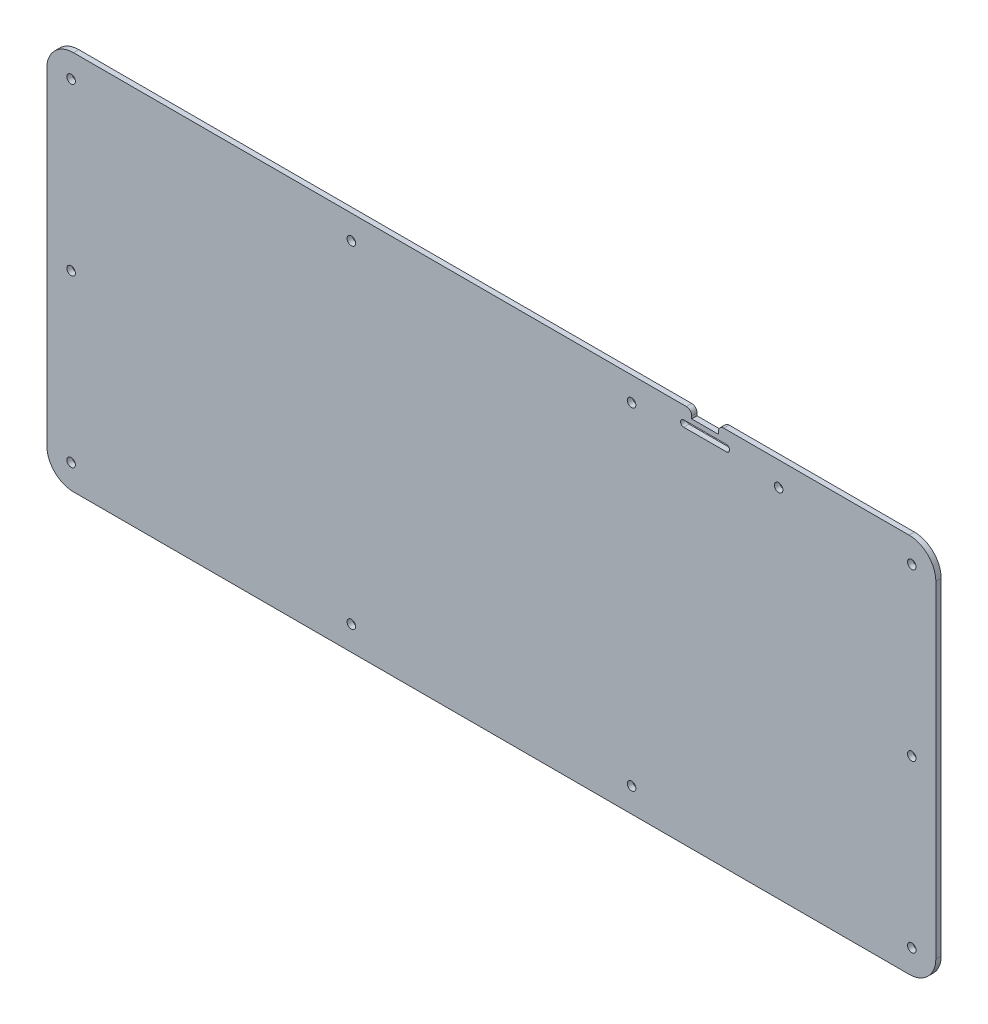
ISO-10303-21;
HEADER;
FILE_DESCRIPTION(('STEP AP214'),'2;1');
FILE_NAME('part.step','',(''),(''),'','','');
FILE_SCHEMA(('AUTOMOTIVE_DESIGN { 1 0 10303 214 1 1 1 1 }'));
ENDSEC;
DATA;
#1=APPLICATION_CONTEXT('core data for automotive mechanical design processes');
#2=APPLICATION_PROTOCOL_DEFINITION('international standard','automotive_design',2000,#1);
#3=PRODUCT_CONTEXT('',#1,'mechanical');
#4=PRODUCT('Part','Part','',(#3));
#5=PRODUCT_RELATED_PRODUCT_CATEGORY('part','',(#4));
#6=PRODUCT_DEFINITION_FORMATION('','',#4);
#7=PRODUCT_DEFINITION_CONTEXT('part definition',#1,'design');
#8=PRODUCT_DEFINITION('design','',#6,#7);
#9=PRODUCT_DEFINITION_SHAPE('','',#8);
#10=(LENGTH_UNIT() NAMED_UNIT(*) SI_UNIT(.MILLI.,.METRE.));
#11=(NAMED_UNIT(*) PLANE_ANGLE_UNIT() SI_UNIT($,.RADIAN.));
#12=(NAMED_UNIT(*) SI_UNIT($,.STERADIAN.) SOLID_ANGLE_UNIT());
#13=UNCERTAINTY_MEASURE_WITH_UNIT(LENGTH_MEASURE(1.E-05),#10,'distance_accuracy_value','');
#14=(GEOMETRIC_REPRESENTATION_CONTEXT(3) GLOBAL_UNCERTAINTY_ASSIGNED_CONTEXT((#13)) GLOBAL_UNIT_ASSIGNED_CONTEXT((#10,
#11,#12)) REPRESENTATION_CONTEXT('',''));
#15=CARTESIAN_POINT('',(0.,0.,0.));
#16=DIRECTION('',(0.,0.,1.));
#17=DIRECTION('',(1.,0.,0.));
#18=AXIS2_PLACEMENT_3D('',#15,#16,#17);
#19=CARTESIAN_POINT('',(-155.158505017761,77.4335797767203,2.));
#20=DIRECTION('',(0.,0.,1.));
#21=DIRECTION('',(1.,0.,0.));
#22=AXIS2_PLACEMENT_3D('',#19,#20,#21);
#23=PLANE('',#22);
#24=CARTESIAN_POINT('',(-51.1295050177609,78.4335797767203,2.));
#25=DIRECTION('',(0.,0.,1.));
#26=DIRECTION('',(1.,0.,0.));
#27=AXIS2_PLACEMENT_3D('',#24,#25,#26);
#28=CIRCLE('',#27,1.59999999999996);
#29=CARTESIAN_POINT('',(-49.5295050177609,78.4335797767203,2.));
#30=VERTEX_POINT('',#29);
#31=EDGE_CURVE('E1257',#30,#30,#28,.T.);
#32=ORIENTED_EDGE('',*,*,#31,.F.);
#33=EDGE_LOOP('',(#32));
#34=FACE_BOUND('',#33,.T.);
#35=CARTESIAN_POINT('',(-156.063435017761,16.2824797767203,2.));
#36=DIRECTION('',(0.,0.,1.));
#37=DIRECTION('',(1.,0.,0.));
#38=AXIS2_PLACEMENT_3D('',#35,#36,#37);
#39=CIRCLE('',#38,1.5998);
#40=CARTESIAN_POINT('',(-154.463635017761,16.2824797767203,2.));
#41=VERTEX_POINT('',#40);
#42=EDGE_CURVE('E1273',#41,#41,#39,.T.);
#43=ORIENTED_EDGE('',*,*,#42,.F.);
#44=EDGE_LOOP('',(#43));
#45=FACE_BOUND('',#44,.T.);
#46=CARTESIAN_POINT('',(-51.1295050177609,-45.8685202232797,2.));
#47=DIRECTION('',(0.,0.,1.));
#48=DIRECTION('',(1.,0.,0.));
#49=AXIS2_PLACEMENT_3D('',#46,#47,#48);
#50=CIRCLE('',#49,1.59992);
#51=CARTESIAN_POINT('',(-49.5295850177609,-45.8685202232797,2.));
#52=VERTEX_POINT('',#51);
#53=EDGE_CURVE('E1289',#52,#52,#50,.T.);
#54=ORIENTED_EDGE('',*,*,#53,.F.);
#55=EDGE_LOOP('',(#54));
#56=FACE_BOUND('',#55,.T.);
#57=CARTESIAN_POINT('',(158.738494982239,-45.8685202232797,2.));
#58=DIRECTION('',(0.,0.,1.));
#59=DIRECTION('',(1.,0.,0.));
#60=AXIS2_PLACEMENT_3D('',#57,#58,#59);
#61=CIRCLE('',#60,1.59992);
#62=CARTESIAN_POINT('',(160.338414982239,-45.8685202232797,2.));
#63=VERTEX_POINT('',#62);
#64=EDGE_CURVE('E1305',#63,#63,#61,.T.);
#65=ORIENTED_EDGE('',*,*,#64,.F.);
#66=EDGE_LOOP('',(#65));
#67=FACE_BOUND('',#66,.T.);
#68=CARTESIAN_POINT('',(158.738494982239,78.4335797767203,2.));
#69=DIRECTION('',(0.,0.,1.));
#70=DIRECTION('',(1.,0.,0.));
#71=AXIS2_PLACEMENT_3D('',#68,#69,#70);
#72=CIRCLE('',#71,1.59999999999996);
#73=CARTESIAN_POINT('',(160.338494982239,78.4335797767203,2.));
#74=VERTEX_POINT('',#73);
#75=EDGE_CURVE('E1321',#74,#74,#72,.T.);
#76=ORIENTED_EDGE('',*,*,#75,.F.);
#77=EDGE_LOOP('',(#76));
#78=FACE_BOUND('',#77,.T.);
#79=DIRECTION('',(1.,0.,0.));
#80=VECTOR('',#79,1.);
#81=CARTESIAN_POINT('',(73.3374949822391,80.2335797767203,2.));
#82=LINE('',#81,#80);
#83=CARTESIAN_POINT('',(73.3374949822391,80.2335797767203,2.));
#84=VERTEX_POINT('',#83);
#85=CARTESIAN_POINT('',(89.3374949822391,80.2335797767203,2.));
#86=VERTEX_POINT('',#85);
#87=EDGE_CURVE('E723',#84,#86,#82,.T.);
#88=ORIENTED_EDGE('',*,*,#87,.F.);
#89=CARTESIAN_POINT('',(73.3374949822391,81.4335797767203,2.));
#90=DIRECTION('',(0.,0.,1.));
#91=DIRECTION('',(1.,0.,0.));
#92=AXIS2_PLACEMENT_3D('',#89,#90,#91);
#93=CIRCLE('',#92,1.20000000000001);
#94=CARTESIAN_POINT('',(73.3374949822391,82.6335797767203,2.));
#95=VERTEX_POINT('',#94);
#96=EDGE_CURVE('E714',#95,#84,#93,.T.);
#97=ORIENTED_EDGE('',*,*,#96,.F.);
#98=DIRECTION('',(1.,0.,0.));
#99=VECTOR('',#98,1.);
#100=CARTESIAN_POINT('',(73.3374949822391,82.6335797767203,2.));
#101=LINE('',#100,#99);
#102=CARTESIAN_POINT('',(89.3374949822391,82.6335797767203,2.));
#103=VERTEX_POINT('',#102);
#104=EDGE_CURVE('E741',#95,#103,#101,.T.);
#105=ORIENTED_EDGE('',*,*,#104,.T.);
#106=CARTESIAN_POINT('',(89.3374949822391,81.4335797767203,2.));
#107=DIRECTION('',(0.,0.,1.));
#108=DIRECTION('',(1.,0.,0.));
#109=AXIS2_PLACEMENT_3D('',#106,#107,#108);
#110=CIRCLE('',#109,1.20000000000001);
#111=EDGE_CURVE('E737',#86,#103,#110,.T.);
#112=ORIENTED_EDGE('',*,*,#111,.F.);
#113=EDGE_LOOP('',(#88,#97,#105,#112));
#114=FACE_BOUND('',#113,.T.);
#115=CARTESIAN_POINT('',(-155.158505017761,77.4335797767203,2.));
#116=DIRECTION('',(0.,0.,1.));
#117=DIRECTION('',(1.,0.,0.));
#118=AXIS2_PLACEMENT_3D('',#115,#116,#117);
#119=CIRCLE('',#118,10.);
#120=CARTESIAN_POINT('',(-155.158505017761,87.4335797767203,2.));
#121=VERTEX_POINT('',#120);
#122=CARTESIAN_POINT('',(-165.158505017761,77.4335797767203,2.));
#123=VERTEX_POINT('',#122);
#124=EDGE_CURVE('E764',#121,#123,#119,.T.);
#125=ORIENTED_EDGE('',*,*,#124,.T.);
#126=DIRECTION('',(0.,-1.,0.));
#127=VECTOR('',#126,1.);
#128=CARTESIAN_POINT('',(-165.158505017761,77.4335797767203,2.));
#129=LINE('',#128,#127);
#130=CARTESIAN_POINT('',(-165.158505017761,-44.9994202232797,2.));
#131=VERTEX_POINT('',#130);
#132=EDGE_CURVE('E768',#123,#131,#129,.T.);
#133=ORIENTED_EDGE('',*,*,#132,.T.);
#134=CARTESIAN_POINT('',(-155.158505017761,-44.9994202232797,2.));
#135=DIRECTION('',(0.,0.,1.));
#136=DIRECTION('',(1.,0.,0.));
#137=AXIS2_PLACEMENT_3D('',#134,#135,#136);
#138=CIRCLE('',#137,9.99999999999999);
#139=CARTESIAN_POINT('',(-155.158505017761,-54.9994202232797,2.));
#140=VERTEX_POINT('',#139);
#141=EDGE_CURVE('E772',#131,#140,#138,.T.);
#142=ORIENTED_EDGE('',*,*,#141,.T.);
#143=DIRECTION('',(1.,0.,0.));
#144=VECTOR('',#143,1.);
#145=CARTESIAN_POINT('',(-155.158505017761,-54.9994202232797,2.));
#146=LINE('',#145,#144);
#147=CARTESIAN_POINT('',(157.738494982239,-54.9994202232797,2.));
#148=VERTEX_POINT('',#147);
#149=EDGE_CURVE('E775',#140,#148,#146,.T.);
#150=ORIENTED_EDGE('',*,*,#149,.T.);
#151=CARTESIAN_POINT('',(157.738494982239,-44.9994202232797,2.));
#152=DIRECTION('',(0.,0.,1.));
#153=DIRECTION('',(1.,0.,0.));
#154=AXIS2_PLACEMENT_3D('',#151,#152,#153);
#155=CIRCLE('',#154,9.99999999999998);
#156=CARTESIAN_POINT('',(167.738494982239,-44.9994202232797,2.));
#157=VERTEX_POINT('',#156);
#158=EDGE_CURVE('E778',#148,#157,#155,.T.);
#159=ORIENTED_EDGE('',*,*,#158,.T.);
#160=DIRECTION('',(0.,-1.,0.));
#161=VECTOR('',#160,1.);
#162=CARTESIAN_POINT('',(167.738494982239,77.4335797767203,2.));
#163=LINE('',#162,#161);
#164=CARTESIAN_POINT('',(167.738494982239,77.4335797767203,2.));
#165=VERTEX_POINT('',#164);
#166=EDGE_CURVE('E781',#165,#157,#163,.T.);
#167=ORIENTED_EDGE('',*,*,#166,.F.);
#168=CARTESIAN_POINT('',(157.738494982239,77.4335797767203,2.));
#169=DIRECTION('',(0.,0.,-1.));
#170=DIRECTION('',(-1.,0.,0.));
#171=AXIS2_PLACEMENT_3D('',#168,#169,#170);
#172=CIRCLE('',#171,10.);
#173=CARTESIAN_POINT('',(157.738494982239,87.4335797767203,2.));
#174=VERTEX_POINT('',#173);
#175=EDGE_CURVE('E785',#174,#165,#172,.T.);
#176=ORIENTED_EDGE('',*,*,#175,.F.);
#177=DIRECTION('',(1.,0.,0.));
#178=VECTOR('',#177,1.);
#179=CARTESIAN_POINT('',(88.3374949822391,87.4335797767203,2.));
#180=LINE('',#179,#178);
#181=CARTESIAN_POINT('',(88.3374949822391,87.4335797767203,2.));
#182=VERTEX_POINT('',#181);
#183=EDGE_CURVE('E789',#182,#174,#180,.T.);
#184=ORIENTED_EDGE('',*,*,#183,.F.);
#185=CARTESIAN_POINT('',(88.3374949822391,85.4335797767203,2.));
#186=DIRECTION('',(0.,0.,1.));
#187=DIRECTION('',(1.,0.,0.));
#188=AXIS2_PLACEMENT_3D('',#185,#186,#187);
#189=CIRCLE('',#188,2.);
#190=CARTESIAN_POINT('',(86.3374949822391,85.4335797767203,2.));
#191=VERTEX_POINT('',#190);
#192=EDGE_CURVE('E793',#182,#191,#189,.T.);
#193=ORIENTED_EDGE('',*,*,#192,.T.);
#194=DIRECTION('',(0.,-1.,0.));
#195=VECTOR('',#194,1.);
#196=CARTESIAN_POINT('',(86.3374949822391,85.4335797767203,2.));
#197=LINE('',#196,#195);
#198=CARTESIAN_POINT('',(86.3374949822391,84.4335797767203,2.));
#199=VERTEX_POINT('',#198);
#200=EDGE_CURVE('E796',#191,#199,#197,.T.);
#201=ORIENTED_EDGE('',*,*,#200,.T.);
#202=DIRECTION('',(1.,0.,0.));
#203=VECTOR('',#202,1.);
#204=CARTESIAN_POINT('',(76.3374949822391,84.4335797767203,2.));
#205=LINE('',#204,#203);
#206=CARTESIAN_POINT('',(76.3374949822391,84.4335797767203,2.));
#207=VERTEX_POINT('',#206);
#208=EDGE_CURVE('E799',#207,#199,#205,.T.);
#209=ORIENTED_EDGE('',*,*,#208,.F.);
#210=DIRECTION('',(0.,-1.,0.));
#211=VECTOR('',#210,1.);
#212=CARTESIAN_POINT('',(76.3374949822391,85.4335797767203,2.));
#213=LINE('',#212,#211);
#214=CARTESIAN_POINT('',(76.3374949822391,85.4335797767203,2.));
#215=VERTEX_POINT('',#214);
#216=EDGE_CURVE('E803',#215,#207,#213,.T.);
#217=ORIENTED_EDGE('',*,*,#216,.F.);
#218=CARTESIAN_POINT('',(74.3374949822391,85.4335797767203,2.));
#219=DIRECTION('',(0.,0.,-1.));
#220=DIRECTION('',(-1.,0.,0.));
#221=AXIS2_PLACEMENT_3D('',#218,#219,#220);
#222=CIRCLE('',#221,2.);
#223=CARTESIAN_POINT('',(74.3374949822391,87.4335797767203,2.));
#224=VERTEX_POINT('',#223);
#225=EDGE_CURVE('E807',#224,#215,#222,.T.);
#226=ORIENTED_EDGE('',*,*,#225,.F.);
#227=DIRECTION('',(1.,0.,0.));
#228=VECTOR('',#227,1.);
#229=CARTESIAN_POINT('',(-155.158505017761,87.4335797767203,2.));
#230=LINE('',#229,#228);
#231=EDGE_CURVE('E811',#121,#224,#230,.T.);
#232=ORIENTED_EDGE('',*,*,#231,.F.);
#233=EDGE_LOOP('',(#125,#133,#142,#150,#159,#167,#176,#184,#193,#201,#209,#217,#226,#232));
#234=FACE_BOUND('',#233,.T.);
#235=CARTESIAN_POINT('',(108.871494982239,78.4335797767203,2.));
#236=DIRECTION('',(0.,0.,1.));
#237=DIRECTION('',(1.,0.,0.));
#238=AXIS2_PLACEMENT_3D('',#235,#236,#237);
#239=CIRCLE('',#238,1.59999999999996);
#240=CARTESIAN_POINT('',(110.471494982239,78.4335797767203,2.));
#241=VERTEX_POINT('',#240);
#242=EDGE_CURVE('E749',#241,#241,#239,.T.);
#243=ORIENTED_EDGE('',*,*,#242,.F.);
#244=EDGE_LOOP('',(#243));
#245=FACE_BOUND('',#244,.T.);
#246=CARTESIAN_POINT('',(158.738494982239,16.2824797767203,2.));
#247=DIRECTION('',(0.,0.,1.));
#248=DIRECTION('',(1.,0.,0.));
#249=AXIS2_PLACEMENT_3D('',#246,#247,#248);
#250=CIRCLE('',#249,1.59980000000003);
#251=CARTESIAN_POINT('',(160.338294982239,16.2824797767203,2.));
#252=VERTEX_POINT('',#251);
#253=EDGE_CURVE('E1313',#252,#252,#250,.T.);
#254=ORIENTED_EDGE('',*,*,#253,.F.);
#255=EDGE_LOOP('',(#254));
#256=FACE_BOUND('',#255,.T.);
#257=CARTESIAN_POINT('',(53.8034949822391,-45.8685202232797,2.));
#258=DIRECTION('',(0.,0.,1.));
#259=DIRECTION('',(1.,0.,0.));
#260=AXIS2_PLACEMENT_3D('',#257,#258,#259);
#261=CIRCLE('',#260,1.59992);
#262=CARTESIAN_POINT('',(55.4034149822391,-45.8685202232797,2.));
#263=VERTEX_POINT('',#262);
#264=EDGE_CURVE('E1297',#263,#263,#261,.T.);
#265=ORIENTED_EDGE('',*,*,#264,.F.);
#266=EDGE_LOOP('',(#265));
#267=FACE_BOUND('',#266,.T.);
#268=CARTESIAN_POINT('',(-156.063435017761,-45.8685202232797,2.));
#269=DIRECTION('',(0.,0.,1.));
#270=DIRECTION('',(1.,0.,0.));
#271=AXIS2_PLACEMENT_3D('',#268,#269,#270);
#272=CIRCLE('',#271,1.59992);
#273=CARTESIAN_POINT('',(-154.463515017761,-45.8685202232797,2.));
#274=VERTEX_POINT('',#273);
#275=EDGE_CURVE('E1281',#274,#274,#272,.T.);
#276=ORIENTED_EDGE('',*,*,#275,.F.);
#277=EDGE_LOOP('',(#276));
#278=FACE_BOUND('',#277,.T.);
#279=CARTESIAN_POINT('',(-156.063435017761,78.4335797767203,2.));
#280=DIRECTION('',(0.,0.,1.));
#281=DIRECTION('',(1.,0.,0.));
#282=AXIS2_PLACEMENT_3D('',#279,#280,#281);
#283=CIRCLE('',#282,1.59999999999996);
#284=CARTESIAN_POINT('',(-154.463435017761,78.4335797767203,2.));
#285=VERTEX_POINT('',#284);
#286=EDGE_CURVE('E1265',#285,#285,#283,.T.);
#287=ORIENTED_EDGE('',*,*,#286,.F.);
#288=EDGE_LOOP('',(#287));
#289=FACE_BOUND('',#288,.T.);
#290=CARTESIAN_POINT('',(53.8034949822391,78.4335797767203,2.));
#291=DIRECTION('',(0.,0.,1.));
#292=DIRECTION('',(1.,0.,0.));
#293=AXIS2_PLACEMENT_3D('',#290,#291,#292);
#294=CIRCLE('',#293,1.59999999999996);
#295=CARTESIAN_POINT('',(55.4034949822391,78.4335797767203,2.));
#296=VERTEX_POINT('',#295);
#297=EDGE_CURVE('E1246',#296,#296,#294,.T.);
#298=ORIENTED_EDGE('',*,*,#297,.F.);
#299=EDGE_LOOP('',(#298));
#300=FACE_BOUND('',#299,.T.);
#301=ADVANCED_FACE('F588',(#34,#45,#56,#67,#78,#114,#234,#245,#256,#267,#278,#289,#300),#23,.T.);
#302=CARTESIAN_POINT('',(-155.158505017761,77.4335797767203,0.));
#303=DIRECTION('',(0.,0.,1.));
#304=DIRECTION('',(1.,0.,0.));
#305=AXIS2_PLACEMENT_3D('',#302,#303,#304);
#306=PLANE('',#305);
#307=CARTESIAN_POINT('',(-155.158505017761,77.4335797767203,0.));
#308=DIRECTION('',(0.,0.,1.));
#309=DIRECTION('',(1.,0.,0.));
#310=AXIS2_PLACEMENT_3D('',#307,#308,#309);
#311=CIRCLE('',#310,10.);
#312=CARTESIAN_POINT('',(-155.158505017761,87.4335797767203,0.));
#313=VERTEX_POINT('',#312);
#314=CARTESIAN_POINT('',(-165.158505017761,77.4335797767203,0.));
#315=VERTEX_POINT('',#314);
#316=EDGE_CURVE('E732',#313,#315,#311,.T.);
#317=ORIENTED_EDGE('',*,*,#316,.F.);
#318=DIRECTION('',(1.,0.,0.));
#319=VECTOR('',#318,1.);
#320=CARTESIAN_POINT('',(-155.158505017761,87.4335797767203,0.));
#321=LINE('',#320,#319);
#322=CARTESIAN_POINT('',(74.3374949822391,87.4335797767203,0.));
#323=VERTEX_POINT('',#322);
#324=EDGE_CURVE('E769',#313,#323,#321,.T.);
#325=ORIENTED_EDGE('',*,*,#324,.T.);
#326=CARTESIAN_POINT('',(74.3374949822391,85.4335797767203,0.));
#327=DIRECTION('',(0.,0.,-1.));
#328=DIRECTION('',(-1.,0.,0.));
#329=AXIS2_PLACEMENT_3D('',#326,#327,#328);
#330=CIRCLE('',#329,2.);
#331=CARTESIAN_POINT('',(76.3374949822391,85.4335797767203,0.));
#332=VERTEX_POINT('',#331);
#333=EDGE_CURVE('E859',#323,#332,#330,.T.);
#334=ORIENTED_EDGE('',*,*,#333,.T.);
#335=DIRECTION('',(0.,-1.,0.));
#336=VECTOR('',#335,1.);
#337=CARTESIAN_POINT('',(76.3374949822391,85.4335797767203,0.));
#338=LINE('',#337,#336);
#339=CARTESIAN_POINT('',(76.3374949822391,84.4335797767203,0.));
#340=VERTEX_POINT('',#339);
#341=EDGE_CURVE('E855',#332,#340,#338,.T.);
#342=ORIENTED_EDGE('',*,*,#341,.T.);
#343=DIRECTION('',(1.,0.,0.));
#344=VECTOR('',#343,1.);
#345=CARTESIAN_POINT('',(76.3374949822391,84.4335797767203,0.));
#346=LINE('',#345,#344);
#347=CARTESIAN_POINT('',(86.3374949822391,84.4335797767203,0.));
#348=VERTEX_POINT('',#347);
#349=EDGE_CURVE('E851',#340,#348,#346,.T.);
#350=ORIENTED_EDGE('',*,*,#349,.T.);
#351=DIRECTION('',(0.,-1.,0.));
#352=VECTOR('',#351,1.);
#353=CARTESIAN_POINT('',(86.3374949822391,85.4335797767203,0.));
#354=LINE('',#353,#352);
#355=CARTESIAN_POINT('',(86.3374949822391,85.4335797767203,0.));
#356=VERTEX_POINT('',#355);
#357=EDGE_CURVE('E847',#356,#348,#354,.T.);
#358=ORIENTED_EDGE('',*,*,#357,.F.);
#359=CARTESIAN_POINT('',(88.3374949822391,85.4335797767203,0.));
#360=DIRECTION('',(0.,0.,1.));
#361=DIRECTION('',(1.,0.,0.));
#362=AXIS2_PLACEMENT_3D('',#359,#360,#361);
#363=CIRCLE('',#362,2.);
#364=CARTESIAN_POINT('',(88.3374949822391,87.4335797767203,0.));
#365=VERTEX_POINT('',#364);
#366=EDGE_CURVE('E844',#365,#356,#363,.T.);
#367=ORIENTED_EDGE('',*,*,#366,.F.);
#368=DIRECTION('',(1.,0.,0.));
#369=VECTOR('',#368,1.);
#370=CARTESIAN_POINT('',(88.3374949822391,87.4335797767203,0.));
#371=LINE('',#370,#369);
#372=CARTESIAN_POINT('',(157.738494982239,87.4335797767203,0.));
#373=VERTEX_POINT('',#372);
#374=EDGE_CURVE('E840',#365,#373,#371,.T.);
#375=ORIENTED_EDGE('',*,*,#374,.T.);
#376=CARTESIAN_POINT('',(157.738494982239,77.4335797767203,0.));
#377=DIRECTION('',(0.,0.,-1.));
#378=DIRECTION('',(-1.,0.,0.));
#379=AXIS2_PLACEMENT_3D('',#376,#377,#378);
#380=CIRCLE('',#379,10.);
#381=CARTESIAN_POINT('',(167.738494982239,77.4335797767203,0.));
#382=VERTEX_POINT('',#381);
#383=EDGE_CURVE('E836',#373,#382,#380,.T.);
#384=ORIENTED_EDGE('',*,*,#383,.T.);
#385=DIRECTION('',(0.,-1.,0.));
#386=VECTOR('',#385,1.);
#387=CARTESIAN_POINT('',(167.738494982239,77.4335797767203,0.));
#388=LINE('',#387,#386);
#389=CARTESIAN_POINT('',(167.738494982239,-44.9994202232797,0.));
#390=VERTEX_POINT('',#389);
#391=EDGE_CURVE('E832',#382,#390,#388,.T.);
#392=ORIENTED_EDGE('',*,*,#391,.T.);
#393=CARTESIAN_POINT('',(157.738494982239,-44.9994202232797,0.));
#394=DIRECTION('',(0.,0.,1.));
#395=DIRECTION('',(1.,0.,0.));
#396=AXIS2_PLACEMENT_3D('',#393,#394,#395);
#397=CIRCLE('',#396,9.99999999999998);
#398=CARTESIAN_POINT('',(157.738494982239,-54.9994202232797,0.));
#399=VERTEX_POINT('',#398);
#400=EDGE_CURVE('E828',#399,#390,#397,.T.);
#401=ORIENTED_EDGE('',*,*,#400,.F.);
#402=DIRECTION('',(1.,0.,0.));
#403=VECTOR('',#402,1.);
#404=CARTESIAN_POINT('',(-155.158505017761,-54.9994202232797,0.));
#405=LINE('',#404,#403);
#406=CARTESIAN_POINT('',(-155.158505017761,-54.9994202232797,0.));
#407=VERTEX_POINT('',#406);
#408=EDGE_CURVE('E825',#407,#399,#405,.T.);
#409=ORIENTED_EDGE('',*,*,#408,.F.);
#410=CARTESIAN_POINT('',(-155.158505017761,-44.9994202232797,0.));
#411=DIRECTION('',(0.,0.,1.));
#412=DIRECTION('',(1.,0.,0.));
#413=AXIS2_PLACEMENT_3D('',#410,#411,#412);
#414=CIRCLE('',#413,9.99999999999999);
#415=CARTESIAN_POINT('',(-165.158505017761,-44.9994202232797,0.));
#416=VERTEX_POINT('',#415);
#417=EDGE_CURVE('E822',#416,#407,#414,.T.);
#418=ORIENTED_EDGE('',*,*,#417,.F.);
#419=DIRECTION('',(0.,-1.,0.));
#420=VECTOR('',#419,1.);
#421=CARTESIAN_POINT('',(-165.158505017761,77.4335797767203,0.));
#422=LINE('',#421,#420);
#423=EDGE_CURVE('E819',#315,#416,#422,.T.);
#424=ORIENTED_EDGE('',*,*,#423,.F.);
#425=EDGE_LOOP('',(#317,#325,#334,#342,#350,#358,#367,#375,#384,#392,#401,#409,#418,#424));
#426=FACE_BOUND('',#425,.T.);
#427=CARTESIAN_POINT('',(73.3374949822391,81.4335797767203,0.));
#428=DIRECTION('',(0.,0.,1.));
#429=DIRECTION('',(1.,0.,0.));
#430=AXIS2_PLACEMENT_3D('',#427,#428,#429);
#431=CIRCLE('',#430,1.20000000000001);
#432=CARTESIAN_POINT('',(73.3374949822391,82.6335797767203,0.));
#433=VERTEX_POINT('',#432);
#434=CARTESIAN_POINT('',(73.3374949822391,80.2335797767203,0.));
#435=VERTEX_POINT('',#434);
#436=EDGE_CURVE('E612',#433,#435,#431,.T.);
#437=ORIENTED_EDGE('',*,*,#436,.T.);
#438=DIRECTION('',(1.,0.,0.));
#439=VECTOR('',#438,1.);
#440=CARTESIAN_POINT('',(73.3374949822391,80.2335797767203,0.));
#441=LINE('',#440,#439);
#442=CARTESIAN_POINT('',(89.3374949822391,80.2335797767203,0.));
#443=VERTEX_POINT('',#442);
#444=EDGE_CURVE('E730',#435,#443,#441,.T.);
#445=ORIENTED_EDGE('',*,*,#444,.T.);
#446=CARTESIAN_POINT('',(89.3374949822391,81.4335797767203,0.));
#447=DIRECTION('',(0.,0.,1.));
#448=DIRECTION('',(1.,0.,0.));
#449=AXIS2_PLACEMENT_3D('',#446,#447,#448);
#450=CIRCLE('',#449,1.20000000000001);
#451=CARTESIAN_POINT('',(89.3374949822391,82.6335797767203,0.));
#452=VERTEX_POINT('',#451);
#453=EDGE_CURVE('E752',#443,#452,#450,.T.);
#454=ORIENTED_EDGE('',*,*,#453,.T.);
#455=DIRECTION('',(1.,0.,0.));
#456=VECTOR('',#455,1.);
#457=CARTESIAN_POINT('',(73.3374949822391,82.6335797767203,0.));
#458=LINE('',#457,#456);
#459=EDGE_CURVE('E724',#433,#452,#458,.T.);
#460=ORIENTED_EDGE('',*,*,#459,.F.);
#461=EDGE_LOOP('',(#437,#445,#454,#460));
#462=FACE_BOUND('',#461,.T.);
#463=CARTESIAN_POINT('',(108.871494982239,78.4335797767203,0.));
#464=DIRECTION('',(0.,0.,1.));
#465=DIRECTION('',(1.,0.,0.));
#466=AXIS2_PLACEMENT_3D('',#463,#464,#465);
#467=CIRCLE('',#466,1.59999999999996);
#468=CARTESIAN_POINT('',(110.471494982239,78.4335797767203,0.));
#469=VERTEX_POINT('',#468);
#470=EDGE_CURVE('E1325',#469,#469,#467,.T.);
#471=ORIENTED_EDGE('',*,*,#470,.T.);
#472=EDGE_LOOP('',(#471));
#473=FACE_BOUND('',#472,.T.);
#474=CARTESIAN_POINT('',(158.738494982239,78.4335797767203,0.));
#475=DIRECTION('',(0.,0.,1.));
#476=DIRECTION('',(1.,0.,0.));
#477=AXIS2_PLACEMENT_3D('',#474,#475,#476);
#478=CIRCLE('',#477,1.59999999999996);
#479=CARTESIAN_POINT('',(160.338494982239,78.4335797767203,0.));
#480=VERTEX_POINT('',#479);
#481=EDGE_CURVE('E1317',#480,#480,#478,.T.);
#482=ORIENTED_EDGE('',*,*,#481,.T.);
#483=EDGE_LOOP('',(#482));
#484=FACE_BOUND('',#483,.T.);
#485=CARTESIAN_POINT('',(158.738494982239,16.2824797767203,0.));
#486=DIRECTION('',(0.,0.,1.));
#487=DIRECTION('',(1.,0.,0.));
#488=AXIS2_PLACEMENT_3D('',#485,#486,#487);
#489=CIRCLE('',#488,1.59980000000003);
#490=CARTESIAN_POINT('',(160.338294982239,16.2824797767203,0.));
#491=VERTEX_POINT('',#490);
#492=EDGE_CURVE('E1309',#491,#491,#489,.T.);
#493=ORIENTED_EDGE('',*,*,#492,.T.);
#494=EDGE_LOOP('',(#493));
#495=FACE_BOUND('',#494,.T.);
#496=CARTESIAN_POINT('',(158.738494982239,-45.8685202232797,0.));
#497=DIRECTION('',(0.,0.,1.));
#498=DIRECTION('',(1.,0.,0.));
#499=AXIS2_PLACEMENT_3D('',#496,#497,#498);
#500=CIRCLE('',#499,1.59992);
#501=CARTESIAN_POINT('',(160.338414982239,-45.8685202232797,0.));
#502=VERTEX_POINT('',#501);
#503=EDGE_CURVE('E1301',#502,#502,#500,.T.);
#504=ORIENTED_EDGE('',*,*,#503,.T.);
#505=EDGE_LOOP('',(#504));
#506=FACE_BOUND('',#505,.T.);
#507=CARTESIAN_POINT('',(53.8034949822391,-45.8685202232797,0.));
#508=DIRECTION('',(0.,0.,1.));
#509=DIRECTION('',(1.,0.,0.));
#510=AXIS2_PLACEMENT_3D('',#507,#508,#509);
#511=CIRCLE('',#510,1.59992);
#512=CARTESIAN_POINT('',(55.4034149822391,-45.8685202232797,0.));
#513=VERTEX_POINT('',#512);
#514=EDGE_CURVE('E1293',#513,#513,#511,.T.);
#515=ORIENTED_EDGE('',*,*,#514,.T.);
#516=EDGE_LOOP('',(#515));
#517=FACE_BOUND('',#516,.T.);
#518=CARTESIAN_POINT('',(-51.1295050177609,-45.8685202232797,0.));
#519=DIRECTION('',(0.,0.,1.));
#520=DIRECTION('',(1.,0.,0.));
#521=AXIS2_PLACEMENT_3D('',#518,#519,#520);
#522=CIRCLE('',#521,1.59992);
#523=CARTESIAN_POINT('',(-49.5295850177609,-45.8685202232797,0.));
#524=VERTEX_POINT('',#523);
#525=EDGE_CURVE('E1285',#524,#524,#522,.T.);
#526=ORIENTED_EDGE('',*,*,#525,.T.);
#527=EDGE_LOOP('',(#526));
#528=FACE_BOUND('',#527,.T.);
#529=CARTESIAN_POINT('',(-156.063435017761,-45.8685202232797,0.));
#530=DIRECTION('',(0.,0.,1.));
#531=DIRECTION('',(1.,0.,0.));
#532=AXIS2_PLACEMENT_3D('',#529,#530,#531);
#533=CIRCLE('',#532,1.59992);
#534=CARTESIAN_POINT('',(-154.463515017761,-45.8685202232797,0.));
#535=VERTEX_POINT('',#534);
#536=EDGE_CURVE('E1277',#535,#535,#533,.T.);
#537=ORIENTED_EDGE('',*,*,#536,.T.);
#538=EDGE_LOOP('',(#537));
#539=FACE_BOUND('',#538,.T.);
#540=CARTESIAN_POINT('',(-156.063435017761,16.2824797767203,0.));
#541=DIRECTION('',(0.,0.,1.));
#542=DIRECTION('',(1.,0.,0.));
#543=AXIS2_PLACEMENT_3D('',#540,#541,#542);
#544=CIRCLE('',#543,1.5998);
#545=CARTESIAN_POINT('',(-154.463635017761,16.2824797767203,0.));
#546=VERTEX_POINT('',#545);
#547=EDGE_CURVE('E1269',#546,#546,#544,.T.);
#548=ORIENTED_EDGE('',*,*,#547,.T.);
#549=EDGE_LOOP('',(#548));
#550=FACE_BOUND('',#549,.T.);
#551=CARTESIAN_POINT('',(-156.063435017761,78.4335797767203,0.));
#552=DIRECTION('',(0.,0.,1.));
#553=DIRECTION('',(1.,0.,0.));
#554=AXIS2_PLACEMENT_3D('',#551,#552,#553);
#555=CIRCLE('',#554,1.59999999999996);
#556=CARTESIAN_POINT('',(-154.463435017761,78.4335797767203,0.));
#557=VERTEX_POINT('',#556);
#558=EDGE_CURVE('E1261',#557,#557,#555,.T.);
#559=ORIENTED_EDGE('',*,*,#558,.T.);
#560=EDGE_LOOP('',(#559));
#561=FACE_BOUND('',#560,.T.);
#562=CARTESIAN_POINT('',(-51.1295050177609,78.4335797767203,0.));
#563=DIRECTION('',(0.,0.,1.));
#564=DIRECTION('',(1.,0.,0.));
#565=AXIS2_PLACEMENT_3D('',#562,#563,#564);
#566=CIRCLE('',#565,1.59999999999996);
#567=CARTESIAN_POINT('',(-49.5295050177609,78.4335797767203,0.));
#568=VERTEX_POINT('',#567);
#569=EDGE_CURVE('E1254',#568,#568,#566,.T.);
#570=ORIENTED_EDGE('',*,*,#569,.T.);
#571=EDGE_LOOP('',(#570));
#572=FACE_BOUND('',#571,.T.);
#573=CARTESIAN_POINT('',(53.8034949822391,78.4335797767203,0.));
#574=DIRECTION('',(0.,0.,1.));
#575=DIRECTION('',(1.,0.,0.));
#576=AXIS2_PLACEMENT_3D('',#573,#574,#575);
#577=CIRCLE('',#576,1.59999999999996);
#578=CARTESIAN_POINT('',(55.4034949822391,78.4335797767203,0.));
#579=VERTEX_POINT('',#578);
#580=EDGE_CURVE('E1249',#579,#579,#577,.T.);
#581=ORIENTED_EDGE('',*,*,#580,.T.);
#582=EDGE_LOOP('',(#581));
#583=FACE_BOUND('',#582,.T.);
#584=ADVANCED_FACE('F915',(#426,#462,#473,#484,#495,#506,#517,#528,#539,#550,#561,#572,#583),
#306,.F.);
#585=CARTESIAN_POINT('',(-155.158505017761,77.4335797767203,2.));
#586=DIRECTION('',(0.,0.,-1.));
#587=DIRECTION('',(-1.,0.,0.));
#588=AXIS2_PLACEMENT_3D('',#585,#586,#587);
#589=CYLINDRICAL_SURFACE('',#588,10.);
#590=ORIENTED_EDGE('',*,*,#316,.T.);
#591=DIRECTION('',(0.,0.,-1.));
#592=VECTOR('',#591,1.);
#593=CARTESIAN_POINT('',(-165.158505017761,77.4335797767203,2.));
#594=LINE('',#593,#592);
#595=EDGE_CURVE('E12',#123,#315,#594,.T.);
#596=ORIENTED_EDGE('',*,*,#595,.F.);
#597=ORIENTED_EDGE('',*,*,#124,.F.);
#598=DIRECTION('',(0.,0.,-1.));
#599=VECTOR('',#598,1.);
#600=CARTESIAN_POINT('',(-155.158505017761,87.4335797767203,2.));
#601=LINE('',#600,#599);
#602=EDGE_CURVE('E815',#121,#313,#601,.T.);
#603=ORIENTED_EDGE('',*,*,#602,.T.);
#604=EDGE_LOOP('',(#590,#596,#597,#603));
#605=FACE_BOUND('',#604,.T.);
#606=ADVANCED_FACE('F590',(#605),#589,.T.);
#607=CARTESIAN_POINT('',(-165.158505017761,77.4335797767203,2.));
#608=DIRECTION('',(1.,0.,0.));
#609=DIRECTION('',(0.,1.,0.));
#610=AXIS2_PLACEMENT_3D('',#607,#608,#609);
#611=PLANE('',#610);
#612=ORIENTED_EDGE('',*,*,#423,.T.);
#613=DIRECTION('',(0.,0.,-1.));
#614=VECTOR('',#613,1.);
#615=CARTESIAN_POINT('',(-165.158505017761,-44.9994202232797,2.));
#616=LINE('',#615,#614);
#617=EDGE_CURVE('E597',#131,#416,#616,.T.);
#618=ORIENTED_EDGE('',*,*,#617,.F.);
#619=ORIENTED_EDGE('',*,*,#132,.F.);
#620=ORIENTED_EDGE('',*,*,#595,.T.);
#621=EDGE_LOOP('',(#612,#618,#619,#620));
#622=FACE_BOUND('',#621,.T.);
#623=ADVANCED_FACE('F932',(#622),#611,.F.);
#624=CARTESIAN_POINT('',(-155.158505017761,-44.9994202232797,2.));
#625=DIRECTION('',(0.,0.,-1.));
#626=DIRECTION('',(-1.,0.,0.));
#627=AXIS2_PLACEMENT_3D('',#624,#625,#626);
#628=CYLINDRICAL_SURFACE('',#627,9.99999999999999);
#629=ORIENTED_EDGE('',*,*,#417,.T.);
#630=DIRECTION('',(0.,0.,-1.));
#631=VECTOR('',#630,1.);
#632=CARTESIAN_POINT('',(-155.158505017761,-54.9994202232797,2.));
#633=LINE('',#632,#631);
#634=EDGE_CURVE('E900',#140,#407,#633,.T.);
#635=ORIENTED_EDGE('',*,*,#634,.F.);
#636=ORIENTED_EDGE('',*,*,#141,.F.);
#637=ORIENTED_EDGE('',*,*,#617,.T.);
#638=EDGE_LOOP('',(#629,#635,#636,#637));
#639=FACE_BOUND('',#638,.T.);
#640=ADVANCED_FACE('F909',(#639),#628,.T.);
#641=CARTESIAN_POINT('',(-155.158505017761,-54.9994202232797,2.));
#642=DIRECTION('',(0.,1.,0.));
#643=DIRECTION('',(0.,0.,1.));
#644=AXIS2_PLACEMENT_3D('',#641,#642,#643);
#645=PLANE('',#644);
#646=ORIENTED_EDGE('',*,*,#408,.T.);
#647=DIRECTION('',(0.,0.,-1.));
#648=VECTOR('',#647,1.);
#649=CARTESIAN_POINT('',(157.738494982239,-54.9994202232797,2.));
#650=LINE('',#649,#648);
#651=EDGE_CURVE('E896',#148,#399,#650,.T.);
#652=ORIENTED_EDGE('',*,*,#651,.F.);
#653=ORIENTED_EDGE('',*,*,#149,.F.);
#654=ORIENTED_EDGE('',*,*,#634,.T.);
#655=EDGE_LOOP('',(#646,#652,#653,#654));
#656=FACE_BOUND('',#655,.T.);
#657=ADVANCED_FACE('F920',(#656),#645,.F.);
#658=CARTESIAN_POINT('',(157.738494982239,-44.9994202232797,2.));
#659=DIRECTION('',(0.,0.,-1.));
#660=DIRECTION('',(-1.,0.,0.));
#661=AXIS2_PLACEMENT_3D('',#658,#659,#660);
#662=CYLINDRICAL_SURFACE('',#661,9.99999999999998);
#663=ORIENTED_EDGE('',*,*,#400,.T.);
#664=DIRECTION('',(0.,0.,-1.));
#665=VECTOR('',#664,1.);
#666=CARTESIAN_POINT('',(167.738494982239,-44.9994202232797,2.));
#667=LINE('',#666,#665);
#668=EDGE_CURVE('E893',#157,#390,#667,.T.);
#669=ORIENTED_EDGE('',*,*,#668,.F.);
#670=ORIENTED_EDGE('',*,*,#158,.F.);
#671=ORIENTED_EDGE('',*,*,#651,.T.);
#672=EDGE_LOOP('',(#663,#669,#670,#671));
#673=FACE_BOUND('',#672,.T.);
#674=ADVANCED_FACE('F924',(#673),#662,.T.);
#675=CARTESIAN_POINT('',(167.738494982239,77.4335797767203,2.));
#676=DIRECTION('',(1.,0.,0.));
#677=DIRECTION('',(0.,1.,0.));
#678=AXIS2_PLACEMENT_3D('',#675,#676,#677);
#679=PLANE('',#678);
#680=ORIENTED_EDGE('',*,*,#391,.F.);
#681=DIRECTION('',(0.,0.,-1.));
#682=VECTOR('',#681,1.);
#683=CARTESIAN_POINT('',(167.738494982239,77.4335797767203,2.));
#684=LINE('',#683,#682);
#685=EDGE_CURVE('E890',#165,#382,#684,.T.);
#686=ORIENTED_EDGE('',*,*,#685,.F.);
#687=ORIENTED_EDGE('',*,*,#166,.T.);
#688=ORIENTED_EDGE('',*,*,#668,.T.);
#689=EDGE_LOOP('',(#680,#686,#687,#688));
#690=FACE_BOUND('',#689,.T.);
#691=ADVANCED_FACE('F967',(#690),#679,.T.);
#692=CARTESIAN_POINT('',(157.738494982239,77.4335797767203,2.));
#693=DIRECTION('',(0.,0.,-1.));
#694=DIRECTION('',(-1.,0.,0.));
#695=AXIS2_PLACEMENT_3D('',#692,#693,#694);
#696=CYLINDRICAL_SURFACE('',#695,10.);
#697=ORIENTED_EDGE('',*,*,#383,.F.);
#698=DIRECTION('',(0.,0.,-1.));
#699=VECTOR('',#698,1.);
#700=CARTESIAN_POINT('',(157.738494982239,87.4335797767203,2.));
#701=LINE('',#700,#699);
#702=EDGE_CURVE('E887',#174,#373,#701,.T.);
#703=ORIENTED_EDGE('',*,*,#702,.F.);
#704=ORIENTED_EDGE('',*,*,#175,.T.);
#705=ORIENTED_EDGE('',*,*,#685,.T.);
#706=EDGE_LOOP('',(#697,#703,#704,#705));
#707=FACE_BOUND('',#706,.T.);
#708=ADVANCED_FACE('F964',(#707),#696,.T.);
#709=CARTESIAN_POINT('',(88.3374949822391,87.4335797767203,2.));
#710=DIRECTION('',(0.,1.,0.));
#711=DIRECTION('',(0.,0.,1.));
#712=AXIS2_PLACEMENT_3D('',#709,#710,#711);
#713=PLANE('',#712);
#714=ORIENTED_EDGE('',*,*,#374,.F.);
#715=DIRECTION('',(0.,0.,-1.));
#716=VECTOR('',#715,1.);
#717=CARTESIAN_POINT('',(88.3374949822391,87.4335797767203,2.));
#718=LINE('',#717,#716);
#719=EDGE_CURVE('E884',#182,#365,#718,.T.);
#720=ORIENTED_EDGE('',*,*,#719,.F.);
#721=ORIENTED_EDGE('',*,*,#183,.T.);
#722=ORIENTED_EDGE('',*,*,#702,.T.);
#723=EDGE_LOOP('',(#714,#720,#721,#722));
#724=FACE_BOUND('',#723,.T.);
#725=ADVANCED_FACE('F959',(#724),#713,.T.);
#726=CARTESIAN_POINT('',(88.3374949822391,85.4335797767203,2.));
#727=DIRECTION('',(0.,0.,-1.));
#728=DIRECTION('',(-1.,0.,0.));
#729=AXIS2_PLACEMENT_3D('',#726,#727,#728);
#730=CYLINDRICAL_SURFACE('',#729,2.);
#731=ORIENTED_EDGE('',*,*,#366,.T.);
#732=DIRECTION('',(0.,0.,-1.));
#733=VECTOR('',#732,1.);
#734=CARTESIAN_POINT('',(86.3374949822391,85.4335797767203,2.));
#735=LINE('',#734,#733);
#736=EDGE_CURVE('E880',#191,#356,#735,.T.);
#737=ORIENTED_EDGE('',*,*,#736,.F.);
#738=ORIENTED_EDGE('',*,*,#192,.F.);
#739=ORIENTED_EDGE('',*,*,#719,.T.);
#740=EDGE_LOOP('',(#731,#737,#738,#739));
#741=FACE_BOUND('',#740,.T.);
#742=ADVANCED_FACE('F998',(#741),#730,.T.);
#743=CARTESIAN_POINT('',(86.3374949822391,85.4335797767203,2.));
#744=DIRECTION('',(1.,0.,0.));
#745=DIRECTION('',(0.,1.,0.));
#746=AXIS2_PLACEMENT_3D('',#743,#744,#745);
#747=PLANE('',#746);
#748=ORIENTED_EDGE('',*,*,#357,.T.);
#749=DIRECTION('',(0.,0.,-1.));
#750=VECTOR('',#749,1.);
#751=CARTESIAN_POINT('',(86.3374949822391,84.4335797767203,2.));
#752=LINE('',#751,#750);
#753=EDGE_CURVE('E877',#199,#348,#752,.T.);
#754=ORIENTED_EDGE('',*,*,#753,.F.);
#755=ORIENTED_EDGE('',*,*,#200,.F.);
#756=ORIENTED_EDGE('',*,*,#736,.T.);
#757=EDGE_LOOP('',(#748,#754,#755,#756));
#758=FACE_BOUND('',#757,.T.);
#759=ADVANCED_FACE('F953',(#758),#747,.F.);
#760=CARTESIAN_POINT('',(76.3374949822391,84.4335797767203,2.));
#761=DIRECTION('',(0.,1.,0.));
#762=DIRECTION('',(0.,0.,1.));
#763=AXIS2_PLACEMENT_3D('',#760,#761,#762);
#764=PLANE('',#763);
#765=ORIENTED_EDGE('',*,*,#349,.F.);
#766=DIRECTION('',(0.,0.,-1.));
#767=VECTOR('',#766,1.);
#768=CARTESIAN_POINT('',(76.3374949822391,84.4335797767203,2.));
#769=LINE('',#768,#767);
#770=EDGE_CURVE('E874',#207,#340,#769,.T.);
#771=ORIENTED_EDGE('',*,*,#770,.F.);
#772=ORIENTED_EDGE('',*,*,#208,.T.);
#773=ORIENTED_EDGE('',*,*,#753,.T.);
#774=EDGE_LOOP('',(#765,#771,#772,#773));
#775=FACE_BOUND('',#774,.T.);
#776=ADVANCED_FACE('F949',(#775),#764,.T.);
#777=CARTESIAN_POINT('',(76.3374949822391,85.4335797767203,2.));
#778=DIRECTION('',(1.,0.,0.));
#779=DIRECTION('',(0.,0.,-1.));
#780=AXIS2_PLACEMENT_3D('',#777,#778,#779);
#781=PLANE('',#780);
#782=ORIENTED_EDGE('',*,*,#341,.F.);
#783=DIRECTION('',(0.,0.,-1.));
#784=VECTOR('',#783,1.);
#785=CARTESIAN_POINT('',(76.3374949822391,85.4335797767203,2.));
#786=LINE('',#785,#784);
#787=EDGE_CURVE('E871',#215,#332,#786,.T.);
#788=ORIENTED_EDGE('',*,*,#787,.F.);
#789=ORIENTED_EDGE('',*,*,#216,.T.);
#790=ORIENTED_EDGE('',*,*,#770,.T.);
#791=EDGE_LOOP('',(#782,#788,#789,#790));
#792=FACE_BOUND('',#791,.T.);
#793=ADVANCED_FACE('F945',(#792),#781,.T.);
#794=CARTESIAN_POINT('',(74.3374949822391,85.4335797767203,2.));
#795=DIRECTION('',(0.,0.,-1.));
#796=DIRECTION('',(-1.,0.,0.));
#797=AXIS2_PLACEMENT_3D('',#794,#795,#796);
#798=CYLINDRICAL_SURFACE('',#797,2.);
#799=ORIENTED_EDGE('',*,*,#333,.F.);
#800=DIRECTION('',(0.,0.,-1.));
#801=VECTOR('',#800,1.);
#802=CARTESIAN_POINT('',(74.3374949822391,87.4335797767203,2.));
#803=LINE('',#802,#801);
#804=EDGE_CURVE('E868',#224,#323,#803,.T.);
#805=ORIENTED_EDGE('',*,*,#804,.F.);
#806=ORIENTED_EDGE('',*,*,#225,.T.);
#807=ORIENTED_EDGE('',*,*,#787,.T.);
#808=EDGE_LOOP('',(#799,#805,#806,#807));
#809=FACE_BOUND('',#808,.T.);
#810=ADVANCED_FACE('F940',(#809),#798,.T.);
#811=CARTESIAN_POINT('',(-155.158505017761,87.4335797767203,2.));
#812=DIRECTION('',(0.,1.,0.));
#813=DIRECTION('',(0.,0.,1.));
#814=AXIS2_PLACEMENT_3D('',#811,#812,#813);
#815=PLANE('',#814);
#816=ORIENTED_EDGE('',*,*,#324,.F.);
#817=ORIENTED_EDGE('',*,*,#602,.F.);
#818=ORIENTED_EDGE('',*,*,#231,.T.);
#819=ORIENTED_EDGE('',*,*,#804,.T.);
#820=EDGE_LOOP('',(#816,#817,#818,#819));
#821=FACE_BOUND('',#820,.T.);
#822=ADVANCED_FACE('F936',(#821),#815,.T.);
#823=CARTESIAN_POINT('',(73.3374949822391,81.4335797767203,2.));
#824=DIRECTION('',(0.,0.,-1.));
#825=DIRECTION('',(-1.,0.,0.));
#826=AXIS2_PLACEMENT_3D('',#823,#824,#825);
#827=CYLINDRICAL_SURFACE('',#826,1.20000000000001);
#828=ORIENTED_EDGE('',*,*,#436,.F.);
#829=DIRECTION('',(0.,0.,-1.));
#830=VECTOR('',#829,1.);
#831=CARTESIAN_POINT('',(73.3374949822391,82.6335797767203,2.));
#832=LINE('',#831,#830);
#833=EDGE_CURVE('E718',#95,#433,#832,.T.);
#834=ORIENTED_EDGE('',*,*,#833,.F.);
#835=ORIENTED_EDGE('',*,*,#96,.T.);
#836=DIRECTION('',(0.,0.,-1.));
#837=VECTOR('',#836,1.);
#838=CARTESIAN_POINT('',(73.3374949822391,80.2335797767203,2.));
#839=LINE('',#838,#837);
#840=EDGE_CURVE('E717',#84,#435,#839,.T.);
#841=ORIENTED_EDGE('',*,*,#840,.T.);
#842=EDGE_LOOP('',(#828,#834,#835,#841));
#843=FACE_BOUND('',#842,.T.);
#844=ADVANCED_FACE('F716',(#843),#827,.F.);
#845=CARTESIAN_POINT('',(73.3374949822391,80.2335797767203,2.));
#846=DIRECTION('',(0.,1.,0.));
#847=DIRECTION('',(0.,0.,1.));
#848=AXIS2_PLACEMENT_3D('',#845,#846,#847);
#849=PLANE('',#848);
#850=ORIENTED_EDGE('',*,*,#444,.F.);
#851=ORIENTED_EDGE('',*,*,#840,.F.);
#852=ORIENTED_EDGE('',*,*,#87,.T.);
#853=DIRECTION('',(0.,0.,-1.));
#854=VECTOR('',#853,1.);
#855=CARTESIAN_POINT('',(89.3374949822391,80.2335797767203,2.));
#856=LINE('',#855,#854);
#857=EDGE_CURVE('E733',#86,#443,#856,.T.);
#858=ORIENTED_EDGE('',*,*,#857,.T.);
#859=EDGE_LOOP('',(#850,#851,#852,#858));
#860=FACE_BOUND('',#859,.T.);
#861=ADVANCED_FACE('F727',(#860),#849,.T.);
#862=CARTESIAN_POINT('',(89.3374949822391,81.4335797767203,2.));
#863=DIRECTION('',(0.,0.,-1.));
#864=DIRECTION('',(-1.,0.,0.));
#865=AXIS2_PLACEMENT_3D('',#862,#863,#864);
#866=CYLINDRICAL_SURFACE('',#865,1.20000000000001);
#867=ORIENTED_EDGE('',*,*,#453,.F.);
#868=ORIENTED_EDGE('',*,*,#857,.F.);
#869=ORIENTED_EDGE('',*,*,#111,.T.);
#870=DIRECTION('',(0.,0.,-1.));
#871=VECTOR('',#870,1.);
#872=CARTESIAN_POINT('',(89.3374949822391,82.6335797767203,2.));
#873=LINE('',#872,#871);
#874=EDGE_CURVE('E604',#103,#452,#873,.T.);
#875=ORIENTED_EDGE('',*,*,#874,.T.);
#876=EDGE_LOOP('',(#867,#868,#869,#875));
#877=FACE_BOUND('',#876,.T.);
#878=ADVANCED_FACE('F1041',(#877),#866,.F.);
#879=CARTESIAN_POINT('',(73.3374949822391,82.6335797767203,2.));
#880=DIRECTION('',(0.,1.,0.));
#881=DIRECTION('',(0.,0.,1.));
#882=AXIS2_PLACEMENT_3D('',#879,#880,#881);
#883=PLANE('',#882);
#884=ORIENTED_EDGE('',*,*,#459,.T.);
#885=ORIENTED_EDGE('',*,*,#874,.F.);
#886=ORIENTED_EDGE('',*,*,#104,.F.);
#887=ORIENTED_EDGE('',*,*,#833,.T.);
#888=EDGE_LOOP('',(#884,#885,#886,#887));
#889=FACE_BOUND('',#888,.T.);
#890=ADVANCED_FACE('F1047',(#889),#883,.F.);
#891=CARTESIAN_POINT('',(108.871494982239,78.4335797767203,2.));
#892=DIRECTION('',(0.,0.,-1.));
#893=DIRECTION('',(-1.,0.,0.));
#894=AXIS2_PLACEMENT_3D('',#891,#892,#893);
#895=CYLINDRICAL_SURFACE('',#894,1.59999999999996);
#896=ORIENTED_EDGE('',*,*,#242,.T.);
#897=EDGE_LOOP('',(#896));
#898=FACE_BOUND('',#897,.T.);
#899=ORIENTED_EDGE('',*,*,#470,.F.);
#900=EDGE_LOOP('',(#899));
#901=FACE_BOUND('',#900,.T.);
#902=ADVANCED_FACE('F1055',(#898,#901),#895,.F.);
#903=CARTESIAN_POINT('',(158.738494982239,78.4335797767203,2.));
#904=DIRECTION('',(0.,0.,-1.));
#905=DIRECTION('',(-1.,0.,0.));
#906=AXIS2_PLACEMENT_3D('',#903,#904,#905);
#907=CYLINDRICAL_SURFACE('',#906,1.59999999999996);
#908=ORIENTED_EDGE('',*,*,#75,.T.);
#909=EDGE_LOOP('',(#908));
#910=FACE_BOUND('',#909,.T.);
#911=ORIENTED_EDGE('',*,*,#481,.F.);
#912=EDGE_LOOP('',(#911));
#913=FACE_BOUND('',#912,.T.);
#914=ADVANCED_FACE('F1062',(#910,#913),#907,.F.);
#915=CARTESIAN_POINT('',(158.738494982239,16.2824797767203,2.));
#916=DIRECTION('',(0.,0.,-1.));
#917=DIRECTION('',(-1.,0.,0.));
#918=AXIS2_PLACEMENT_3D('',#915,#916,#917);
#919=CYLINDRICAL_SURFACE('',#918,1.59980000000003);
#920=ORIENTED_EDGE('',*,*,#253,.T.);
#921=EDGE_LOOP('',(#920));
#922=FACE_BOUND('',#921,.T.);
#923=ORIENTED_EDGE('',*,*,#492,.F.);
#924=EDGE_LOOP('',(#923));
#925=FACE_BOUND('',#924,.T.);
#926=ADVANCED_FACE('F1070',(#922,#925),#919,.F.);
#927=CARTESIAN_POINT('',(158.738494982239,-45.8685202232797,2.));
#928=DIRECTION('',(0.,0.,-1.));
#929=DIRECTION('',(-1.,0.,0.));
#930=AXIS2_PLACEMENT_3D('',#927,#928,#929);
#931=CYLINDRICAL_SURFACE('',#930,1.59992);
#932=ORIENTED_EDGE('',*,*,#64,.T.);
#933=EDGE_LOOP('',(#932));
#934=FACE_BOUND('',#933,.T.);
#935=ORIENTED_EDGE('',*,*,#503,.F.);
#936=EDGE_LOOP('',(#935));
#937=FACE_BOUND('',#936,.T.);
#938=ADVANCED_FACE('F1078',(#934,#937),#931,.F.);
#939=CARTESIAN_POINT('',(53.8034949822391,-45.8685202232797,2.));
#940=DIRECTION('',(0.,0.,-1.));
#941=DIRECTION('',(-1.,0.,0.));
#942=AXIS2_PLACEMENT_3D('',#939,#940,#941);
#943=CYLINDRICAL_SURFACE('',#942,1.59992);
#944=ORIENTED_EDGE('',*,*,#264,.T.);
#945=EDGE_LOOP('',(#944));
#946=FACE_BOUND('',#945,.T.);
#947=ORIENTED_EDGE('',*,*,#514,.F.);
#948=EDGE_LOOP('',(#947));
#949=FACE_BOUND('',#948,.T.);
#950=ADVANCED_FACE('F1086',(#946,#949),#943,.F.);
#951=CARTESIAN_POINT('',(-51.1295050177609,-45.8685202232797,2.));
#952=DIRECTION('',(0.,0.,-1.));
#953=DIRECTION('',(-1.,0.,0.));
#954=AXIS2_PLACEMENT_3D('',#951,#952,#953);
#955=CYLINDRICAL_SURFACE('',#954,1.59992);
#956=ORIENTED_EDGE('',*,*,#53,.T.);
#957=EDGE_LOOP('',(#956));
#958=FACE_BOUND('',#957,.T.);
#959=ORIENTED_EDGE('',*,*,#525,.F.);
#960=EDGE_LOOP('',(#959));
#961=FACE_BOUND('',#960,.T.);
#962=ADVANCED_FACE('F1094',(#958,#961),#955,.F.);
#963=CARTESIAN_POINT('',(-156.063435017761,-45.8685202232797,2.));
#964=DIRECTION('',(0.,0.,-1.));
#965=DIRECTION('',(-1.,0.,0.));
#966=AXIS2_PLACEMENT_3D('',#963,#964,#965);
#967=CYLINDRICAL_SURFACE('',#966,1.59992);
#968=ORIENTED_EDGE('',*,*,#275,.T.);
#969=EDGE_LOOP('',(#968));
#970=FACE_BOUND('',#969,.T.);
#971=ORIENTED_EDGE('',*,*,#536,.F.);
#972=EDGE_LOOP('',(#971));
#973=FACE_BOUND('',#972,.T.);
#974=ADVANCED_FACE('F1102',(#970,#973),#967,.F.);
#975=CARTESIAN_POINT('',(-156.063435017761,16.2824797767203,2.));
#976=DIRECTION('',(0.,0.,-1.));
#977=DIRECTION('',(-1.,0.,0.));
#978=AXIS2_PLACEMENT_3D('',#975,#976,#977);
#979=CYLINDRICAL_SURFACE('',#978,1.5998);
#980=ORIENTED_EDGE('',*,*,#42,.T.);
#981=EDGE_LOOP('',(#980));
#982=FACE_BOUND('',#981,.T.);
#983=ORIENTED_EDGE('',*,*,#547,.F.);
#984=EDGE_LOOP('',(#983));
#985=FACE_BOUND('',#984,.T.);
#986=ADVANCED_FACE('F1110',(#982,#985),#979,.F.);
#987=CARTESIAN_POINT('',(-156.063435017761,78.4335797767203,2.));
#988=DIRECTION('',(0.,0.,-1.));
#989=DIRECTION('',(-1.,0.,0.));
#990=AXIS2_PLACEMENT_3D('',#987,#988,#989);
#991=CYLINDRICAL_SURFACE('',#990,1.59999999999996);
#992=ORIENTED_EDGE('',*,*,#286,.T.);
#993=EDGE_LOOP('',(#992));
#994=FACE_BOUND('',#993,.T.);
#995=ORIENTED_EDGE('',*,*,#558,.F.);
#996=EDGE_LOOP('',(#995));
#997=FACE_BOUND('',#996,.T.);
#998=ADVANCED_FACE('F1118',(#994,#997),#991,.F.);
#999=CARTESIAN_POINT('',(-51.1295050177609,78.4335797767203,2.));
#1000=DIRECTION('',(0.,0.,-1.));
#1001=DIRECTION('',(-1.,0.,0.));
#1002=AXIS2_PLACEMENT_3D('',#999,#1000,#1001);
#1003=CYLINDRICAL_SURFACE('',#1002,1.59999999999996);
#1004=ORIENTED_EDGE('',*,*,#31,.T.);
#1005=EDGE_LOOP('',(#1004));
#1006=FACE_BOUND('',#1005,.T.);
#1007=ORIENTED_EDGE('',*,*,#569,.F.);
#1008=EDGE_LOOP('',(#1007));
#1009=FACE_BOUND('',#1008,.T.);
#1010=ADVANCED_FACE('F1126',(#1006,#1009),#1003,.F.);
#1011=CARTESIAN_POINT('',(53.8034949822391,78.4335797767203,2.));
#1012=DIRECTION('',(0.,0.,-1.));
#1013=DIRECTION('',(-1.,0.,0.));
#1014=AXIS2_PLACEMENT_3D('',#1011,#1012,#1013);
#1015=CYLINDRICAL_SURFACE('',#1014,1.59999999999996);
#1016=ORIENTED_EDGE('',*,*,#297,.T.);
#1017=EDGE_LOOP('',(#1016));
#1018=FACE_BOUND('',#1017,.T.);
#1019=ORIENTED_EDGE('',*,*,#580,.F.);
#1020=EDGE_LOOP('',(#1019));
#1021=FACE_BOUND('',#1020,.T.);
#1022=ADVANCED_FACE('F1134',(#1018,#1021),#1015,.F.);
#1023=CLOSED_SHELL('',(#301,#584,#606,#623,#640,#657,#674,#691,#708,#725,#742,#759,#776,#793,
#810,#822,#844,#861,#878,#890,#902,#914,#926,#938,#950,#962,#974,#986,#998,#1010,#1022));
#1024=MANIFOLD_SOLID_BREP('B2',#1023);
#1025=ADVANCED_BREP_SHAPE_REPRESENTATION('',(#18,#1024),#14);
#1026=SHAPE_DEFINITION_REPRESENTATION(#9,#1025);
ENDSEC;
END-ISO-10303-21;
